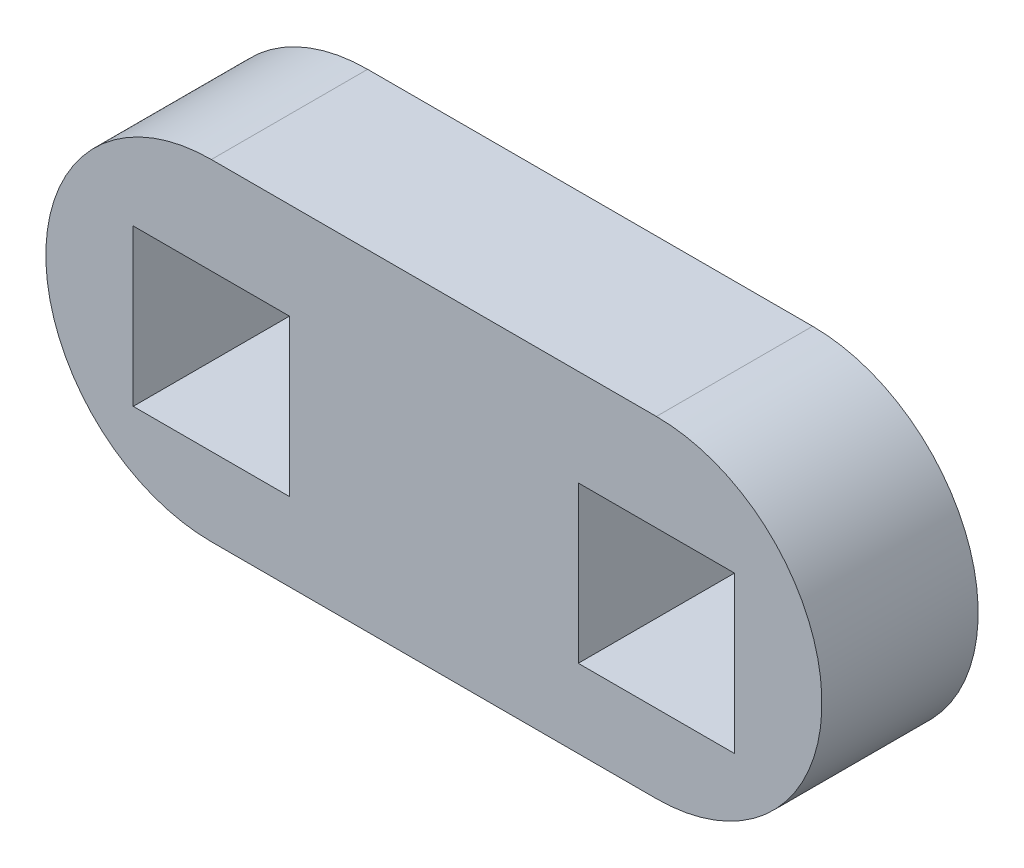
ISO-10303-21;
HEADER;
FILE_DESCRIPTION(('STEP AP214'),'2;1');
FILE_NAME('part.step','',(''),(''),'','','');
FILE_SCHEMA(('AUTOMOTIVE_DESIGN { 1 0 10303 214 1 1 1 1 }'));
ENDSEC;
DATA;
#1=APPLICATION_CONTEXT('core data for automotive mechanical design processes');
#2=APPLICATION_PROTOCOL_DEFINITION('international standard','automotive_design',2000,#1);
#3=PRODUCT_CONTEXT('',#1,'mechanical');
#4=PRODUCT('Part','Part','',(#3));
#5=PRODUCT_RELATED_PRODUCT_CATEGORY('part','',(#4));
#6=PRODUCT_DEFINITION_FORMATION('','',#4);
#7=PRODUCT_DEFINITION_CONTEXT('part definition',#1,'design');
#8=PRODUCT_DEFINITION('design','',#6,#7);
#9=PRODUCT_DEFINITION_SHAPE('','',#8);
#10=(LENGTH_UNIT() NAMED_UNIT(*) SI_UNIT(.MILLI.,.METRE.));
#11=(NAMED_UNIT(*) PLANE_ANGLE_UNIT() SI_UNIT($,.RADIAN.));
#12=(NAMED_UNIT(*) SI_UNIT($,.STERADIAN.) SOLID_ANGLE_UNIT());
#13=UNCERTAINTY_MEASURE_WITH_UNIT(LENGTH_MEASURE(1.E-05),#10,'distance_accuracy_value','');
#14=(GEOMETRIC_REPRESENTATION_CONTEXT(3) GLOBAL_UNCERTAINTY_ASSIGNED_CONTEXT((#13)) GLOBAL_UNIT_ASSIGNED_CONTEXT((#10,
#11,#12)) REPRESENTATION_CONTEXT('',''));
#15=CARTESIAN_POINT('',(0.,0.,0.));
#16=DIRECTION('',(0.,0.,1.));
#17=DIRECTION('',(1.,0.,0.));
#18=AXIS2_PLACEMENT_3D('',#15,#16,#17);
#19=CARTESIAN_POINT('',(384.610540850945,118.343994152131,5.9944));
#20=DIRECTION('',(0.,0.,1.));
#21=DIRECTION('',(1.,0.,0.));
#22=AXIS2_PLACEMENT_3D('',#19,#20,#21);
#23=PLANE('',#22);
#24=CARTESIAN_POINT('',(384.610540850945,118.343994152131,5.9944));
#25=DIRECTION('',(0.,0.,1.));
#26=DIRECTION('',(1.,0.,0.));
#27=AXIS2_PLACEMENT_3D('',#24,#25,#26);
#28=CIRCLE('',#27,6.34999999999999);
#29=CARTESIAN_POINT('',(384.610540850945,111.993994152131,5.9944));
#30=VERTEX_POINT('',#29);
#31=CARTESIAN_POINT('',(384.610540850945,124.693994152131,5.9944));
#32=VERTEX_POINT('',#31);
#33=EDGE_CURVE('E212',#30,#32,#28,.T.);
#34=ORIENTED_EDGE('',*,*,#33,.T.);
#35=DIRECTION('',(-1.,0.,0.));
#36=VECTOR('',#35,1.);
#37=CARTESIAN_POINT('',(367.53776539084,124.693994152131,5.9944));
#38=LINE('',#37,#36);
#39=CARTESIAN_POINT('',(367.53776539084,124.693994152131,5.9944));
#40=VERTEX_POINT('',#39);
#41=EDGE_CURVE('E217',#32,#40,#38,.T.);
#42=ORIENTED_EDGE('',*,*,#41,.T.);
#43=CARTESIAN_POINT('',(367.53776539084,118.343994152131,5.9944));
#44=DIRECTION('',(0.,0.,1.));
#45=DIRECTION('',(1.,0.,0.));
#46=AXIS2_PLACEMENT_3D('',#43,#44,#45);
#47=CIRCLE('',#46,6.35000000000011);
#48=CARTESIAN_POINT('',(367.53776539084,111.993994152131,5.9944));
#49=VERTEX_POINT('',#48);
#50=EDGE_CURVE('E225',#40,#49,#47,.T.);
#51=ORIENTED_EDGE('',*,*,#50,.T.);
#52=DIRECTION('',(1.,0.,0.));
#53=VECTOR('',#52,1.);
#54=CARTESIAN_POINT('',(384.610540850945,111.993994152131,5.9944));
#55=LINE('',#54,#53);
#56=EDGE_CURVE('E228',#49,#30,#55,.T.);
#57=ORIENTED_EDGE('',*,*,#56,.T.);
#58=EDGE_LOOP('',(#34,#42,#51,#57));
#59=FACE_BOUND('',#58,.T.);
#60=DIRECTION('',(-1.,0.,0.));
#61=VECTOR('',#60,1.);
#62=CARTESIAN_POINT('',(387.607740850945,120.988448440542,5.9944));
#63=LINE('',#62,#61);
#64=CARTESIAN_POINT('',(387.607740850945,120.988448440542,5.9944));
#65=VERTEX_POINT('',#64);
#66=CARTESIAN_POINT('',(381.613340850945,120.988448440542,5.9944));
#67=VERTEX_POINT('',#66);
#68=EDGE_CURVE('E178',#65,#67,#63,.T.);
#69=ORIENTED_EDGE('',*,*,#68,.F.);
#70=DIRECTION('',(0.,1.,0.));
#71=VECTOR('',#70,1.);
#72=CARTESIAN_POINT('',(387.607740850945,114.994048440542,5.9944));
#73=LINE('',#72,#71);
#74=CARTESIAN_POINT('',(387.607740850945,114.994048440542,5.9944));
#75=VERTEX_POINT('',#74);
#76=EDGE_CURVE('E174',#75,#65,#73,.T.);
#77=ORIENTED_EDGE('',*,*,#76,.F.);
#78=DIRECTION('',(1.,0.,0.));
#79=VECTOR('',#78,1.);
#80=CARTESIAN_POINT('',(387.607740850945,114.994048440542,5.9944));
#81=LINE('',#80,#79);
#82=CARTESIAN_POINT('',(381.613340850945,114.994048440542,5.9944));
#83=VERTEX_POINT('',#82);
#84=EDGE_CURVE('E185',#83,#75,#81,.T.);
#85=ORIENTED_EDGE('',*,*,#84,.F.);
#86=DIRECTION('',(0.,-1.,0.));
#87=VECTOR('',#86,1.);
#88=CARTESIAN_POINT('',(381.613340850945,114.994048440542,5.9944));
#89=LINE('',#88,#87);
#90=EDGE_CURVE('E190',#67,#83,#89,.T.);
#91=ORIENTED_EDGE('',*,*,#90,.F.);
#92=EDGE_LOOP('',(#69,#77,#85,#91));
#93=FACE_BOUND('',#92,.T.);
#94=DIRECTION('',(1.,0.,0.));
#95=VECTOR('',#94,1.);
#96=CARTESIAN_POINT('',(364.540565390845,114.994048440543,5.9944));
#97=LINE('',#96,#95);
#98=CARTESIAN_POINT('',(364.540565390845,114.994048440543,5.9944));
#99=VERTEX_POINT('',#98);
#100=CARTESIAN_POINT('',(370.534965390845,114.994048440543,5.9944));
#101=VERTEX_POINT('',#100);
#102=EDGE_CURVE('E134',#99,#101,#97,.T.);
#103=ORIENTED_EDGE('',*,*,#102,.F.);
#104=DIRECTION('',(0.,-1.,0.));
#105=VECTOR('',#104,1.);
#106=CARTESIAN_POINT('',(364.540565390845,120.988448440543,5.9944));
#107=LINE('',#106,#105);
#108=CARTESIAN_POINT('',(364.540565390845,120.988448440543,5.9944));
#109=VERTEX_POINT('',#108);
#110=EDGE_CURVE('E125',#109,#99,#107,.T.);
#111=ORIENTED_EDGE('',*,*,#110,.F.);
#112=DIRECTION('',(-1.,0.,0.));
#113=VECTOR('',#112,1.);
#114=CARTESIAN_POINT('',(364.540565390845,120.988448440543,5.9944));
#115=LINE('',#114,#113);
#116=CARTESIAN_POINT('',(370.534965390845,120.988448440543,5.9944));
#117=VERTEX_POINT('',#116);
#118=EDGE_CURVE('E151',#117,#109,#115,.T.);
#119=ORIENTED_EDGE('',*,*,#118,.F.);
#120=DIRECTION('',(0.,1.,0.));
#121=VECTOR('',#120,1.);
#122=CARTESIAN_POINT('',(370.534965390845,120.988448440543,5.9944));
#123=LINE('',#122,#121);
#124=EDGE_CURVE('E146',#101,#117,#123,.T.);
#125=ORIENTED_EDGE('',*,*,#124,.F.);
#126=EDGE_LOOP('',(#103,#111,#119,#125));
#127=FACE_BOUND('',#126,.T.);
#128=ADVANCED_FACE('F36',(#59,#93,#127),#23,.T.);
#129=CARTESIAN_POINT('',(384.610540850945,118.343994152131,0.));
#130=DIRECTION('',(0.,0.,1.));
#131=DIRECTION('',(1.,0.,0.));
#132=AXIS2_PLACEMENT_3D('',#129,#130,#131);
#133=PLANE('',#132);
#134=DIRECTION('',(0.,1.,0.));
#135=VECTOR('',#134,1.);
#136=CARTESIAN_POINT('',(387.607740850945,114.994048440542,0.));
#137=LINE('',#136,#135);
#138=CARTESIAN_POINT('',(387.607740850945,114.994048440542,0.));
#139=VERTEX_POINT('',#138);
#140=CARTESIAN_POINT('',(387.607740850945,120.988448440542,0.));
#141=VERTEX_POINT('',#140);
#142=EDGE_CURVE('E142',#139,#141,#137,.T.);
#143=ORIENTED_EDGE('',*,*,#142,.T.);
#144=DIRECTION('',(-1.,0.,0.));
#145=VECTOR('',#144,1.);
#146=CARTESIAN_POINT('',(387.607740850945,120.988448440542,0.));
#147=LINE('',#146,#145);
#148=CARTESIAN_POINT('',(381.613340850945,120.988448440542,0.));
#149=VERTEX_POINT('',#148);
#150=EDGE_CURVE('E194',#141,#149,#147,.T.);
#151=ORIENTED_EDGE('',*,*,#150,.T.);
#152=DIRECTION('',(0.,-1.,0.));
#153=VECTOR('',#152,1.);
#154=CARTESIAN_POINT('',(381.613340850945,114.994048440542,0.));
#155=LINE('',#154,#153);
#156=CARTESIAN_POINT('',(381.613340850945,114.994048440542,0.));
#157=VERTEX_POINT('',#156);
#158=EDGE_CURVE('E197',#149,#157,#155,.T.);
#159=ORIENTED_EDGE('',*,*,#158,.T.);
#160=DIRECTION('',(1.,0.,0.));
#161=VECTOR('',#160,1.);
#162=CARTESIAN_POINT('',(387.607740850945,114.994048440542,0.));
#163=LINE('',#162,#161);
#164=EDGE_CURVE('E179',#157,#139,#163,.T.);
#165=ORIENTED_EDGE('',*,*,#164,.T.);
#166=EDGE_LOOP('',(#143,#151,#159,#165));
#167=FACE_BOUND('',#166,.T.);
#168=CARTESIAN_POINT('',(384.610540850945,118.343994152131,0.));
#169=DIRECTION('',(0.,0.,1.));
#170=DIRECTION('',(1.,0.,0.));
#171=AXIS2_PLACEMENT_3D('',#168,#169,#170);
#172=CIRCLE('',#171,6.34999999999999);
#173=CARTESIAN_POINT('',(384.610540850945,111.993994152131,0.));
#174=VERTEX_POINT('',#173);
#175=CARTESIAN_POINT('',(384.610540850945,124.693994152131,0.));
#176=VERTEX_POINT('',#175);
#177=EDGE_CURVE('E211',#174,#176,#172,.T.);
#178=ORIENTED_EDGE('',*,*,#177,.F.);
#179=DIRECTION('',(1.,0.,0.));
#180=VECTOR('',#179,1.);
#181=CARTESIAN_POINT('',(384.610540850945,111.993994152131,0.));
#182=LINE('',#181,#180);
#183=CARTESIAN_POINT('',(367.53776539084,111.993994152131,0.));
#184=VERTEX_POINT('',#183);
#185=EDGE_CURVE('E218',#184,#174,#182,.T.);
#186=ORIENTED_EDGE('',*,*,#185,.F.);
#187=CARTESIAN_POINT('',(367.53776539084,118.343994152131,0.));
#188=DIRECTION('',(0.,0.,1.));
#189=DIRECTION('',(1.,0.,0.));
#190=AXIS2_PLACEMENT_3D('',#187,#188,#189);
#191=CIRCLE('',#190,6.35000000000011);
#192=CARTESIAN_POINT('',(367.53776539084,124.693994152131,0.));
#193=VERTEX_POINT('',#192);
#194=EDGE_CURVE('E237',#193,#184,#191,.T.);
#195=ORIENTED_EDGE('',*,*,#194,.F.);
#196=DIRECTION('',(-1.,0.,0.));
#197=VECTOR('',#196,1.);
#198=CARTESIAN_POINT('',(367.53776539084,124.693994152131,0.));
#199=LINE('',#198,#197);
#200=EDGE_CURVE('E235',#176,#193,#199,.T.);
#201=ORIENTED_EDGE('',*,*,#200,.F.);
#202=EDGE_LOOP('',(#178,#186,#195,#201));
#203=FACE_BOUND('',#202,.T.);
#204=DIRECTION('',(0.,-1.,0.));
#205=VECTOR('',#204,1.);
#206=CARTESIAN_POINT('',(364.540565390845,120.988448440543,0.));
#207=LINE('',#206,#205);
#208=CARTESIAN_POINT('',(364.540565390845,120.988448440543,0.));
#209=VERTEX_POINT('',#208);
#210=CARTESIAN_POINT('',(364.540565390845,114.994048440543,0.));
#211=VERTEX_POINT('',#210);
#212=EDGE_CURVE('E59',#209,#211,#207,.T.);
#213=ORIENTED_EDGE('',*,*,#212,.T.);
#214=DIRECTION('',(1.,0.,0.));
#215=VECTOR('',#214,1.);
#216=CARTESIAN_POINT('',(364.540565390845,114.994048440543,0.));
#217=LINE('',#216,#215);
#218=CARTESIAN_POINT('',(370.534965390845,114.994048440543,0.));
#219=VERTEX_POINT('',#218);
#220=EDGE_CURVE('E141',#211,#219,#217,.T.);
#221=ORIENTED_EDGE('',*,*,#220,.T.);
#222=DIRECTION('',(0.,1.,0.));
#223=VECTOR('',#222,1.);
#224=CARTESIAN_POINT('',(370.534965390845,120.988448440543,0.));
#225=LINE('',#224,#223);
#226=CARTESIAN_POINT('',(370.534965390845,120.988448440543,0.));
#227=VERTEX_POINT('',#226);
#228=EDGE_CURVE('E166',#219,#227,#225,.T.);
#229=ORIENTED_EDGE('',*,*,#228,.T.);
#230=DIRECTION('',(-1.,0.,0.));
#231=VECTOR('',#230,1.);
#232=CARTESIAN_POINT('',(364.540565390845,120.988448440543,0.));
#233=LINE('',#232,#231);
#234=EDGE_CURVE('E135',#227,#209,#233,.T.);
#235=ORIENTED_EDGE('',*,*,#234,.T.);
#236=EDGE_LOOP('',(#213,#221,#229,#235));
#237=FACE_BOUND('',#236,.T.);
#238=ADVANCED_FACE('F255',(#167,#203,#237),#133,.F.);
#239=CARTESIAN_POINT('',(384.610540850945,118.343994152131,5.9944));
#240=DIRECTION('',(0.,0.,-1.));
#241=DIRECTION('',(-1.,0.,0.));
#242=AXIS2_PLACEMENT_3D('',#239,#240,#241);
#243=CYLINDRICAL_SURFACE('',#242,6.34999999999999);
#244=ORIENTED_EDGE('',*,*,#177,.T.);
#245=DIRECTION('',(0.,0.,-1.));
#246=VECTOR('',#245,1.);
#247=CARTESIAN_POINT('',(384.610540850945,124.693994152131,5.9944));
#248=LINE('',#247,#246);
#249=EDGE_CURVE('E12',#32,#176,#248,.T.);
#250=ORIENTED_EDGE('',*,*,#249,.F.);
#251=ORIENTED_EDGE('',*,*,#33,.F.);
#252=DIRECTION('',(0.,0.,-1.));
#253=VECTOR('',#252,1.);
#254=CARTESIAN_POINT('',(384.610540850945,111.993994152131,5.9944));
#255=LINE('',#254,#253);
#256=EDGE_CURVE('E232',#30,#174,#255,.T.);
#257=ORIENTED_EDGE('',*,*,#256,.T.);
#258=EDGE_LOOP('',(#244,#250,#251,#257));
#259=FACE_BOUND('',#258,.T.);
#260=ADVANCED_FACE('F38',(#259),#243,.T.);
#261=CARTESIAN_POINT('',(367.53776539084,124.693994152131,5.9944));
#262=DIRECTION('',(0.,-1.,0.));
#263=DIRECTION('',(1.,0.,0.));
#264=AXIS2_PLACEMENT_3D('',#261,#262,#263);
#265=PLANE('',#264);
#266=ORIENTED_EDGE('',*,*,#200,.T.);
#267=DIRECTION('',(0.,0.,-1.));
#268=VECTOR('',#267,1.);
#269=CARTESIAN_POINT('',(367.53776539084,124.693994152131,5.9944));
#270=LINE('',#269,#268);
#271=EDGE_CURVE('E44',#40,#193,#270,.T.);
#272=ORIENTED_EDGE('',*,*,#271,.F.);
#273=ORIENTED_EDGE('',*,*,#41,.F.);
#274=ORIENTED_EDGE('',*,*,#249,.T.);
#275=EDGE_LOOP('',(#266,#272,#273,#274));
#276=FACE_BOUND('',#275,.T.);
#277=ADVANCED_FACE('F305',(#276),#265,.F.);
#278=CARTESIAN_POINT('',(367.53776539084,118.343994152131,5.9944));
#279=DIRECTION('',(0.,0.,-1.));
#280=DIRECTION('',(-1.,0.,0.));
#281=AXIS2_PLACEMENT_3D('',#278,#279,#280);
#282=CYLINDRICAL_SURFACE('',#281,6.35000000000011);
#283=ORIENTED_EDGE('',*,*,#194,.T.);
#284=DIRECTION('',(0.,0.,-1.));
#285=VECTOR('',#284,1.);
#286=CARTESIAN_POINT('',(367.53776539084,111.993994152131,5.9944));
#287=LINE('',#286,#285);
#288=EDGE_CURVE('E242',#49,#184,#287,.T.);
#289=ORIENTED_EDGE('',*,*,#288,.F.);
#290=ORIENTED_EDGE('',*,*,#50,.F.);
#291=ORIENTED_EDGE('',*,*,#271,.T.);
#292=EDGE_LOOP('',(#283,#289,#290,#291));
#293=FACE_BOUND('',#292,.T.);
#294=ADVANCED_FACE('F249',(#293),#282,.T.);
#295=CARTESIAN_POINT('',(384.610540850945,111.993994152131,5.9944));
#296=DIRECTION('',(0.,1.,0.));
#297=DIRECTION('',(-1.,0.,0.));
#298=AXIS2_PLACEMENT_3D('',#295,#296,#297);
#299=PLANE('',#298);
#300=ORIENTED_EDGE('',*,*,#185,.T.);
#301=ORIENTED_EDGE('',*,*,#256,.F.);
#302=ORIENTED_EDGE('',*,*,#56,.F.);
#303=ORIENTED_EDGE('',*,*,#288,.T.);
#304=EDGE_LOOP('',(#300,#301,#302,#303));
#305=FACE_BOUND('',#304,.T.);
#306=ADVANCED_FACE('F259',(#305),#299,.F.);
#307=CARTESIAN_POINT('',(387.607740850945,114.994048440542,5.9944));
#308=DIRECTION('',(-1.,0.,0.));
#309=DIRECTION('',(0.,0.,1.));
#310=AXIS2_PLACEMENT_3D('',#307,#308,#309);
#311=PLANE('',#310);
#312=ORIENTED_EDGE('',*,*,#142,.F.);
#313=DIRECTION('',(0.,0.,-1.));
#314=VECTOR('',#313,1.);
#315=CARTESIAN_POINT('',(387.607740850945,114.994048440542,5.9944));
#316=LINE('',#315,#314);
#317=EDGE_CURVE('E189',#75,#139,#316,.T.);
#318=ORIENTED_EDGE('',*,*,#317,.F.);
#319=ORIENTED_EDGE('',*,*,#76,.T.);
#320=DIRECTION('',(0.,0.,-1.));
#321=VECTOR('',#320,1.);
#322=CARTESIAN_POINT('',(387.607740850945,120.988448440542,5.9944));
#323=LINE('',#322,#321);
#324=EDGE_CURVE('E208',#65,#141,#323,.T.);
#325=ORIENTED_EDGE('',*,*,#324,.T.);
#326=EDGE_LOOP('',(#312,#318,#319,#325));
#327=FACE_BOUND('',#326,.T.);
#328=ADVANCED_FACE('F282',(#327),#311,.T.);
#329=CARTESIAN_POINT('',(387.607740850945,120.988448440542,5.9944));
#330=DIRECTION('',(0.,-1.,0.));
#331=DIRECTION('',(0.,0.,-1.));
#332=AXIS2_PLACEMENT_3D('',#329,#330,#331);
#333=PLANE('',#332);
#334=ORIENTED_EDGE('',*,*,#150,.F.);
#335=ORIENTED_EDGE('',*,*,#324,.F.);
#336=ORIENTED_EDGE('',*,*,#68,.T.);
#337=DIRECTION('',(0.,0.,-1.));
#338=VECTOR('',#337,1.);
#339=CARTESIAN_POINT('',(381.613340850945,120.988448440542,5.9944));
#340=LINE('',#339,#338);
#341=EDGE_CURVE('E206',#67,#149,#340,.T.);
#342=ORIENTED_EDGE('',*,*,#341,.T.);
#343=EDGE_LOOP('',(#334,#335,#336,#342));
#344=FACE_BOUND('',#343,.T.);
#345=ADVANCED_FACE('F286',(#344),#333,.T.);
#346=CARTESIAN_POINT('',(381.613340850945,114.994048440542,5.9944));
#347=DIRECTION('',(1.,0.,0.));
#348=DIRECTION('',(0.,0.,-1.));
#349=AXIS2_PLACEMENT_3D('',#346,#347,#348);
#350=PLANE('',#349);
#351=ORIENTED_EDGE('',*,*,#158,.F.);
#352=ORIENTED_EDGE('',*,*,#341,.F.);
#353=ORIENTED_EDGE('',*,*,#90,.T.);
#354=DIRECTION('',(0.,0.,-1.));
#355=VECTOR('',#354,1.);
#356=CARTESIAN_POINT('',(381.613340850945,114.994048440542,5.9944));
#357=LINE('',#356,#355);
#358=EDGE_CURVE('E204',#83,#157,#357,.T.);
#359=ORIENTED_EDGE('',*,*,#358,.T.);
#360=EDGE_LOOP('',(#351,#352,#353,#359));
#361=FACE_BOUND('',#360,.T.);
#362=ADVANCED_FACE('F274',(#361),#350,.T.);
#363=CARTESIAN_POINT('',(387.607740850945,114.994048440542,5.9944));
#364=DIRECTION('',(0.,1.,0.));
#365=DIRECTION('',(0.,0.,1.));
#366=AXIS2_PLACEMENT_3D('',#363,#364,#365);
#367=PLANE('',#366);
#368=ORIENTED_EDGE('',*,*,#164,.F.);
#369=ORIENTED_EDGE('',*,*,#358,.F.);
#370=ORIENTED_EDGE('',*,*,#84,.T.);
#371=ORIENTED_EDGE('',*,*,#317,.T.);
#372=EDGE_LOOP('',(#368,#369,#370,#371));
#373=FACE_BOUND('',#372,.T.);
#374=ADVANCED_FACE('F280',(#373),#367,.T.);
#375=CARTESIAN_POINT('',(364.540565390845,120.988448440543,5.9944));
#376=DIRECTION('',(1.,0.,0.));
#377=DIRECTION('',(0.,0.,-1.));
#378=AXIS2_PLACEMENT_3D('',#375,#376,#377);
#379=PLANE('',#378);
#380=ORIENTED_EDGE('',*,*,#212,.F.);
#381=DIRECTION('',(0.,0.,-1.));
#382=VECTOR('',#381,1.);
#383=CARTESIAN_POINT('',(364.540565390845,120.988448440543,5.9944));
#384=LINE('',#383,#382);
#385=EDGE_CURVE('E129',#109,#209,#384,.T.);
#386=ORIENTED_EDGE('',*,*,#385,.F.);
#387=ORIENTED_EDGE('',*,*,#110,.T.);
#388=DIRECTION('',(0.,0.,-1.));
#389=VECTOR('',#388,1.);
#390=CARTESIAN_POINT('',(364.540565390845,114.994048440543,5.9944));
#391=LINE('',#390,#389);
#392=EDGE_CURVE('E128',#99,#211,#391,.T.);
#393=ORIENTED_EDGE('',*,*,#392,.T.);
#394=EDGE_LOOP('',(#380,#386,#387,#393));
#395=FACE_BOUND('',#394,.T.);
#396=ADVANCED_FACE('F127',(#395),#379,.T.);
#397=CARTESIAN_POINT('',(364.540565390845,114.994048440543,5.9944));
#398=DIRECTION('',(0.,1.,0.));
#399=DIRECTION('',(0.,0.,1.));
#400=AXIS2_PLACEMENT_3D('',#397,#398,#399);
#401=PLANE('',#400);
#402=ORIENTED_EDGE('',*,*,#220,.F.);
#403=ORIENTED_EDGE('',*,*,#392,.F.);
#404=ORIENTED_EDGE('',*,*,#102,.T.);
#405=DIRECTION('',(0.,0.,-1.));
#406=VECTOR('',#405,1.);
#407=CARTESIAN_POINT('',(370.534965390845,114.994048440543,5.9944));
#408=LINE('',#407,#406);
#409=EDGE_CURVE('E143',#101,#219,#408,.T.);
#410=ORIENTED_EDGE('',*,*,#409,.T.);
#411=EDGE_LOOP('',(#402,#403,#404,#410));
#412=FACE_BOUND('',#411,.T.);
#413=ADVANCED_FACE('F138',(#412),#401,.T.);
#414=CARTESIAN_POINT('',(370.534965390845,120.988448440543,5.9944));
#415=DIRECTION('',(-1.,0.,0.));
#416=DIRECTION('',(0.,0.,1.));
#417=AXIS2_PLACEMENT_3D('',#414,#415,#416);
#418=PLANE('',#417);
#419=ORIENTED_EDGE('',*,*,#228,.F.);
#420=ORIENTED_EDGE('',*,*,#409,.F.);
#421=ORIENTED_EDGE('',*,*,#124,.T.);
#422=DIRECTION('',(0.,0.,-1.));
#423=VECTOR('',#422,1.);
#424=CARTESIAN_POINT('',(370.534965390845,120.988448440543,5.9944));
#425=LINE('',#424,#423);
#426=EDGE_CURVE('E51',#117,#227,#425,.T.);
#427=ORIENTED_EDGE('',*,*,#426,.T.);
#428=EDGE_LOOP('',(#419,#420,#421,#427));
#429=FACE_BOUND('',#428,.T.);
#430=ADVANCED_FACE('F374',(#429),#418,.T.);
#431=CARTESIAN_POINT('',(364.540565390845,120.988448440543,5.9944));
#432=DIRECTION('',(0.,-1.,0.));
#433=DIRECTION('',(0.,0.,-1.));
#434=AXIS2_PLACEMENT_3D('',#431,#432,#433);
#435=PLANE('',#434);
#436=ORIENTED_EDGE('',*,*,#234,.F.);
#437=ORIENTED_EDGE('',*,*,#426,.F.);
#438=ORIENTED_EDGE('',*,*,#118,.T.);
#439=ORIENTED_EDGE('',*,*,#385,.T.);
#440=EDGE_LOOP('',(#436,#437,#438,#439));
#441=FACE_BOUND('',#440,.T.);
#442=ADVANCED_FACE('F382',(#441),#435,.T.);
#443=CLOSED_SHELL('',(#128,#238,#260,#277,#294,#306,#328,#345,#362,#374,#396,#413,#430,#442));
#444=MANIFOLD_SOLID_BREP('B2',#443);
#445=ADVANCED_BREP_SHAPE_REPRESENTATION('',(#18,#444),#14);
#446=SHAPE_DEFINITION_REPRESENTATION(#9,#445);
ENDSEC;
END-ISO-10303-21;
